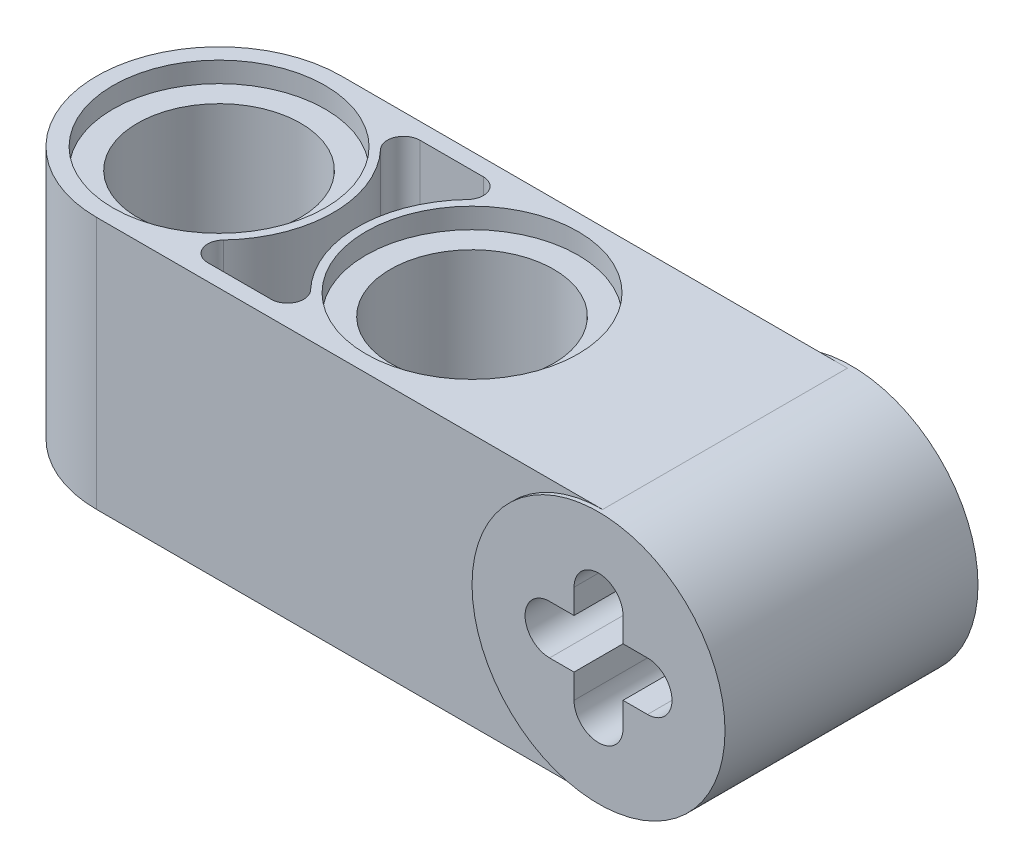
ISO-10303-21;
HEADER;
FILE_DESCRIPTION(('STEP AP214'),'2;1');
FILE_NAME('part.step','',(''),(''),'','','');
FILE_SCHEMA(('AUTOMOTIVE_DESIGN { 1 0 10303 214 1 1 1 1 }'));
ENDSEC;
DATA;
#1=APPLICATION_CONTEXT('core data for automotive mechanical design processes');
#2=APPLICATION_PROTOCOL_DEFINITION('international standard','automotive_design',2000,#1);
#3=PRODUCT_CONTEXT('',#1,'mechanical');
#4=PRODUCT('Part','Part','',(#3));
#5=PRODUCT_RELATED_PRODUCT_CATEGORY('part','',(#4));
#6=PRODUCT_DEFINITION_FORMATION('','',#4);
#7=PRODUCT_DEFINITION_CONTEXT('part definition',#1,'design');
#8=PRODUCT_DEFINITION('design','',#6,#7);
#9=PRODUCT_DEFINITION_SHAPE('','',#8);
#10=(LENGTH_UNIT() NAMED_UNIT(*) SI_UNIT(.MILLI.,.METRE.));
#11=(NAMED_UNIT(*) PLANE_ANGLE_UNIT() SI_UNIT($,.RADIAN.));
#12=(NAMED_UNIT(*) SI_UNIT($,.STERADIAN.) SOLID_ANGLE_UNIT());
#13=UNCERTAINTY_MEASURE_WITH_UNIT(LENGTH_MEASURE(1.E-05),#10,'distance_accuracy_value','');
#14=(GEOMETRIC_REPRESENTATION_CONTEXT(3) GLOBAL_UNCERTAINTY_ASSIGNED_CONTEXT((#13)) GLOBAL_UNIT_ASSIGNED_CONTEXT((#10,
#11,#12)) REPRESENTATION_CONTEXT('',''));
#15=CARTESIAN_POINT('',(0.,0.,0.));
#16=DIRECTION('',(0.,0.,1.));
#17=DIRECTION('',(1.,0.,0.));
#18=AXIS2_PLACEMENT_3D('',#15,#16,#17);
#19=CARTESIAN_POINT('',(7.9375,-8.87295075176705,7.62));
#20=DIRECTION('',(0.,0.,-1.));
#21=DIRECTION('',(1.,0.,0.));
#22=AXIS2_PLACEMENT_3D('',#19,#20,#21);
#23=PLANE('',#22);
#24=CARTESIAN_POINT('',(8.001,0.,7.62));
#25=DIRECTION('',(0.,0.,1.));
#26=DIRECTION('',(1.,0.,0.));
#27=AXIS2_PLACEMENT_3D('',#24,#25,#26);
#28=CIRCLE('',#27,3.937);
#29=CARTESIAN_POINT('',(8.001,3.937,7.62));
#30=VERTEX_POINT('',#29);
#31=CARTESIAN_POINT('',(8.001,-3.937,7.62));
#32=VERTEX_POINT('',#31);
#33=EDGE_CURVE('E59',#30,#32,#28,.T.);
#34=ORIENTED_EDGE('',*,*,#33,.F.);
#35=DIRECTION('',(-1.,0.,0.));
#36=VECTOR('',#35,1.);
#37=CARTESIAN_POINT('',(7.9375,3.937,7.62));
#38=LINE('',#37,#36);
#39=CARTESIAN_POINT('',(-7.74700000000001,3.937,7.62000000000003));
#40=VERTEX_POINT('',#39);
#41=EDGE_CURVE('E408',#30,#40,#38,.T.);
#42=ORIENTED_EDGE('',*,*,#41,.T.);
#43=DIRECTION('',(0.,-1.,0.));
#44=VECTOR('',#43,1.);
#45=CARTESIAN_POINT('',(-7.74700000000001,0.,7.62000000000003));
#46=LINE('',#45,#44);
#47=CARTESIAN_POINT('',(-7.74700000000001,-3.937,7.62000000000003));
#48=VERTEX_POINT('',#47);
#49=EDGE_CURVE('E368',#40,#48,#46,.T.);
#50=ORIENTED_EDGE('',*,*,#49,.T.);
#51=DIRECTION('',(-1.,0.,0.));
#52=VECTOR('',#51,1.);
#53=CARTESIAN_POINT('',(7.93749999999999,-3.937,7.62));
#54=LINE('',#53,#52);
#55=EDGE_CURVE('E404',#32,#48,#54,.T.);
#56=ORIENTED_EDGE('',*,*,#55,.F.);
#57=EDGE_LOOP('',(#34,#42,#50,#56));
#58=FACE_BOUND('',#57,.T.);
#59=ADVANCED_FACE('F34',(#58),#23,.F.);
#60=CARTESIAN_POINT('',(8.001,-1.524,3.81));
#61=DIRECTION('',(0.,0.,-1.));
#62=DIRECTION('',(-1.,0.,0.));
#63=AXIS2_PLACEMENT_3D('',#60,#61,#62);
#64=CYLINDRICAL_SURFACE('',#63,0.762);
#65=DIRECTION('',(0.,0.,-1.));
#66=VECTOR('',#65,1.);
#67=CARTESIAN_POINT('',(8.763,-1.524,3.81));
#68=LINE('',#67,#66);
#69=CARTESIAN_POINT('',(8.763,-1.524,7.747));
#70=VERTEX_POINT('',#69);
#71=CARTESIAN_POINT('',(8.763,-1.524,-0.127));
#72=VERTEX_POINT('',#71);
#73=EDGE_CURVE('E415',#70,#72,#68,.T.);
#74=ORIENTED_EDGE('',*,*,#73,.T.);
#75=CARTESIAN_POINT('',(8.001,-1.524,-0.127));
#76=DIRECTION('',(0.,0.,1.));
#77=DIRECTION('',(1.,0.,0.));
#78=AXIS2_PLACEMENT_3D('',#75,#76,#77);
#79=CIRCLE('',#78,0.762);
#80=CARTESIAN_POINT('',(7.239,-1.524,-0.127));
#81=VERTEX_POINT('',#80);
#82=EDGE_CURVE('E242',#81,#72,#79,.T.);
#83=ORIENTED_EDGE('',*,*,#82,.F.);
#84=DIRECTION('',(0.,0.,-1.));
#85=VECTOR('',#84,1.);
#86=CARTESIAN_POINT('',(7.239,-1.524,3.81));
#87=LINE('',#86,#85);
#88=CARTESIAN_POINT('',(7.239,-1.524,7.747));
#89=VERTEX_POINT('',#88);
#90=EDGE_CURVE('E11',#89,#81,#87,.T.);
#91=ORIENTED_EDGE('',*,*,#90,.F.);
#92=CARTESIAN_POINT('',(8.001,-1.524,7.747));
#93=DIRECTION('',(0.,0.,1.));
#94=DIRECTION('',(1.,0.,0.));
#95=AXIS2_PLACEMENT_3D('',#92,#93,#94);
#96=CIRCLE('',#95,0.762);
#97=EDGE_CURVE('E262',#89,#70,#96,.T.);
#98=ORIENTED_EDGE('',*,*,#97,.T.);
#99=EDGE_LOOP('',(#74,#83,#91,#98));
#100=FACE_BOUND('',#99,.T.);
#101=ADVANCED_FACE('F451',(#100),#64,.F.);
#102=CARTESIAN_POINT('',(7.239,-8.87295075176705,3.81));
#103=DIRECTION('',(1.,0.,0.));
#104=DIRECTION('',(0.,0.,-1.));
#105=AXIS2_PLACEMENT_3D('',#102,#103,#104);
#106=PLANE('',#105);
#107=ORIENTED_EDGE('',*,*,#90,.T.);
#108=DIRECTION('',(0.,-1.,0.));
#109=VECTOR('',#108,1.);
#110=CARTESIAN_POINT('',(7.239,-0.761999999999999,-0.127));
#111=LINE('',#110,#109);
#112=CARTESIAN_POINT('',(7.239,-0.761999999999999,-0.127));
#113=VERTEX_POINT('',#112);
#114=EDGE_CURVE('E245',#113,#81,#111,.T.);
#115=ORIENTED_EDGE('',*,*,#114,.F.);
#116=DIRECTION('',(0.,0.,-1.));
#117=VECTOR('',#116,1.);
#118=CARTESIAN_POINT('',(7.239,-0.761999999999999,3.81));
#119=LINE('',#118,#117);
#120=CARTESIAN_POINT('',(7.239,-0.761999999999999,7.747));
#121=VERTEX_POINT('',#120);
#122=EDGE_CURVE('E43',#121,#113,#119,.T.);
#123=ORIENTED_EDGE('',*,*,#122,.F.);
#124=DIRECTION('',(0.,-1.,0.));
#125=VECTOR('',#124,1.);
#126=CARTESIAN_POINT('',(7.239,-0.761999999999999,7.747));
#127=LINE('',#126,#125);
#128=EDGE_CURVE('E259',#121,#89,#127,.T.);
#129=ORIENTED_EDGE('',*,*,#128,.T.);
#130=EDGE_LOOP('',(#107,#115,#123,#129));
#131=FACE_BOUND('',#130,.T.);
#132=ADVANCED_FACE('F456',(#131),#106,.T.);
#133=CARTESIAN_POINT('',(7.9375,-0.761999999999999,3.81));
#134=DIRECTION('',(0.,1.,0.));
#135=DIRECTION('',(0.,0.,1.));
#136=AXIS2_PLACEMENT_3D('',#133,#134,#135);
#137=PLANE('',#136);
#138=ORIENTED_EDGE('',*,*,#122,.T.);
#139=DIRECTION('',(1.,0.,0.));
#140=VECTOR('',#139,1.);
#141=CARTESIAN_POINT('',(6.477,-0.761999999999999,-0.127));
#142=LINE('',#141,#140);
#143=CARTESIAN_POINT('',(6.477,-0.761999999999999,-0.127));
#144=VERTEX_POINT('',#143);
#145=EDGE_CURVE('E248',#144,#113,#142,.T.);
#146=ORIENTED_EDGE('',*,*,#145,.F.);
#147=DIRECTION('',(0.,0.,-1.));
#148=VECTOR('',#147,1.);
#149=CARTESIAN_POINT('',(6.477,-0.761999999999999,3.81));
#150=LINE('',#149,#148);
#151=CARTESIAN_POINT('',(6.477,-0.761999999999999,7.747));
#152=VERTEX_POINT('',#151);
#153=EDGE_CURVE('E207',#152,#144,#150,.T.);
#154=ORIENTED_EDGE('',*,*,#153,.F.);
#155=DIRECTION('',(1.,0.,0.));
#156=VECTOR('',#155,1.);
#157=CARTESIAN_POINT('',(6.477,-0.761999999999999,7.747));
#158=LINE('',#157,#156);
#159=EDGE_CURVE('E256',#152,#121,#158,.T.);
#160=ORIENTED_EDGE('',*,*,#159,.T.);
#161=EDGE_LOOP('',(#138,#146,#154,#160));
#162=FACE_BOUND('',#161,.T.);
#163=ADVANCED_FACE('F476',(#162),#137,.T.);
#164=CARTESIAN_POINT('',(6.477,0.,3.81));
#165=DIRECTION('',(0.,0.,-1.));
#166=DIRECTION('',(-1.,0.,0.));
#167=AXIS2_PLACEMENT_3D('',#164,#165,#166);
#168=CYLINDRICAL_SURFACE('',#167,0.761999999999999);
#169=ORIENTED_EDGE('',*,*,#153,.T.);
#170=CARTESIAN_POINT('',(6.477,0.,-0.127));
#171=DIRECTION('',(0.,0.,1.));
#172=DIRECTION('',(1.,0.,0.));
#173=AXIS2_PLACEMENT_3D('',#170,#171,#172);
#174=CIRCLE('',#173,0.761999999999999);
#175=CARTESIAN_POINT('',(6.477,0.761999999999999,-0.127));
#176=VERTEX_POINT('',#175);
#177=EDGE_CURVE('E211',#176,#144,#174,.T.);
#178=ORIENTED_EDGE('',*,*,#177,.F.);
#179=DIRECTION('',(0.,0.,-1.));
#180=VECTOR('',#179,1.);
#181=CARTESIAN_POINT('',(6.477,0.761999999999999,3.81));
#182=LINE('',#181,#180);
#183=CARTESIAN_POINT('',(6.477,0.761999999999999,7.747));
#184=VERTEX_POINT('',#183);
#185=EDGE_CURVE('E196',#184,#176,#182,.T.);
#186=ORIENTED_EDGE('',*,*,#185,.F.);
#187=CARTESIAN_POINT('',(6.477,0.,7.747));
#188=DIRECTION('',(0.,0.,1.));
#189=DIRECTION('',(1.,0.,0.));
#190=AXIS2_PLACEMENT_3D('',#187,#188,#189);
#191=CIRCLE('',#190,0.761999999999999);
#192=EDGE_CURVE('E253',#184,#152,#191,.T.);
#193=ORIENTED_EDGE('',*,*,#192,.T.);
#194=EDGE_LOOP('',(#169,#178,#186,#193));
#195=FACE_BOUND('',#194,.T.);
#196=ADVANCED_FACE('F212',(#195),#168,.F.);
#197=CARTESIAN_POINT('',(7.9375,0.761999999999999,3.81));
#198=DIRECTION('',(0.,1.,0.));
#199=DIRECTION('',(0.,0.,1.));
#200=AXIS2_PLACEMENT_3D('',#197,#198,#199);
#201=PLANE('',#200);
#202=ORIENTED_EDGE('',*,*,#185,.T.);
#203=DIRECTION('',(-1.,0.,0.));
#204=VECTOR('',#203,1.);
#205=CARTESIAN_POINT('',(6.477,0.761999999999999,-0.127));
#206=LINE('',#205,#204);
#207=CARTESIAN_POINT('',(7.239,0.761999999999999,-0.127));
#208=VERTEX_POINT('',#207);
#209=EDGE_CURVE('E200',#208,#176,#206,.T.);
#210=ORIENTED_EDGE('',*,*,#209,.F.);
#211=DIRECTION('',(0.,0.,-1.));
#212=VECTOR('',#211,1.);
#213=CARTESIAN_POINT('',(7.239,0.761999999999999,3.81));
#214=LINE('',#213,#212);
#215=CARTESIAN_POINT('',(7.239,0.761999999999999,7.747));
#216=VERTEX_POINT('',#215);
#217=EDGE_CURVE('E208',#216,#208,#214,.T.);
#218=ORIENTED_EDGE('',*,*,#217,.F.);
#219=DIRECTION('',(-1.,0.,0.));
#220=VECTOR('',#219,1.);
#221=CARTESIAN_POINT('',(6.477,0.761999999999999,7.747));
#222=LINE('',#221,#220);
#223=EDGE_CURVE('E203',#216,#184,#222,.T.);
#224=ORIENTED_EDGE('',*,*,#223,.T.);
#225=EDGE_LOOP('',(#202,#210,#218,#224));
#226=FACE_BOUND('',#225,.T.);
#227=ADVANCED_FACE('F198',(#226),#201,.F.);
#228=ORIENTED_EDGE('',*,*,#217,.T.);
#229=DIRECTION('',(0.,-1.,0.));
#230=VECTOR('',#229,1.);
#231=CARTESIAN_POINT('',(7.239,1.524,-0.127));
#232=LINE('',#231,#230);
#233=CARTESIAN_POINT('',(7.239,1.524,-0.127));
#234=VERTEX_POINT('',#233);
#235=EDGE_CURVE('E221',#234,#208,#232,.T.);
#236=ORIENTED_EDGE('',*,*,#235,.F.);
#237=DIRECTION('',(0.,0.,-1.));
#238=VECTOR('',#237,1.);
#239=CARTESIAN_POINT('',(7.239,1.524,3.81));
#240=LINE('',#239,#238);
#241=CARTESIAN_POINT('',(7.239,1.524,7.747));
#242=VERTEX_POINT('',#241);
#243=EDGE_CURVE('E427',#242,#234,#240,.T.);
#244=ORIENTED_EDGE('',*,*,#243,.F.);
#245=DIRECTION('',(0.,-1.,0.));
#246=VECTOR('',#245,1.);
#247=CARTESIAN_POINT('',(7.239,1.524,7.747));
#248=LINE('',#247,#246);
#249=EDGE_CURVE('E283',#242,#216,#248,.T.);
#250=ORIENTED_EDGE('',*,*,#249,.T.);
#251=EDGE_LOOP('',(#228,#236,#244,#250));
#252=FACE_BOUND('',#251,.T.);
#253=ADVANCED_FACE('F487',(#252),#106,.T.);
#254=CARTESIAN_POINT('',(8.001,1.524,3.81));
#255=DIRECTION('',(0.,0.,-1.));
#256=DIRECTION('',(-1.,0.,0.));
#257=AXIS2_PLACEMENT_3D('',#254,#255,#256);
#258=CYLINDRICAL_SURFACE('',#257,0.762);
#259=ORIENTED_EDGE('',*,*,#243,.T.);
#260=CARTESIAN_POINT('',(8.001,1.524,-0.127));
#261=DIRECTION('',(0.,0.,1.));
#262=DIRECTION('',(1.,0.,0.));
#263=AXIS2_PLACEMENT_3D('',#260,#261,#262);
#264=CIRCLE('',#263,0.762);
#265=CARTESIAN_POINT('',(8.763,1.524,-0.127));
#266=VERTEX_POINT('',#265);
#267=EDGE_CURVE('E223',#266,#234,#264,.T.);
#268=ORIENTED_EDGE('',*,*,#267,.F.);
#269=DIRECTION('',(0.,0.,-1.));
#270=VECTOR('',#269,1.);
#271=CARTESIAN_POINT('',(8.763,1.524,3.81));
#272=LINE('',#271,#270);
#273=CARTESIAN_POINT('',(8.763,1.524,7.747));
#274=VERTEX_POINT('',#273);
#275=EDGE_CURVE('E425',#274,#266,#272,.T.);
#276=ORIENTED_EDGE('',*,*,#275,.F.);
#277=CARTESIAN_POINT('',(8.001,1.524,7.747));
#278=DIRECTION('',(0.,0.,1.));
#279=DIRECTION('',(1.,0.,0.));
#280=AXIS2_PLACEMENT_3D('',#277,#278,#279);
#281=CIRCLE('',#280,0.762);
#282=EDGE_CURVE('E280',#274,#242,#281,.T.);
#283=ORIENTED_EDGE('',*,*,#282,.T.);
#284=EDGE_LOOP('',(#259,#268,#276,#283));
#285=FACE_BOUND('',#284,.T.);
#286=ADVANCED_FACE('F484',(#285),#258,.F.);
#287=CARTESIAN_POINT('',(8.763,-8.87295075176705,3.81));
#288=DIRECTION('',(1.,0.,0.));
#289=DIRECTION('',(0.,0.,-1.));
#290=AXIS2_PLACEMENT_3D('',#287,#288,#289);
#291=PLANE('',#290);
#292=ORIENTED_EDGE('',*,*,#275,.T.);
#293=DIRECTION('',(0.,1.,0.));
#294=VECTOR('',#293,1.);
#295=CARTESIAN_POINT('',(8.763,1.524,-0.127));
#296=LINE('',#295,#294);
#297=CARTESIAN_POINT('',(8.763,0.761999999999999,-0.127));
#298=VERTEX_POINT('',#297);
#299=EDGE_CURVE('E227',#298,#266,#296,.T.);
#300=ORIENTED_EDGE('',*,*,#299,.F.);
#301=DIRECTION('',(0.,0.,-1.));
#302=VECTOR('',#301,1.);
#303=CARTESIAN_POINT('',(8.763,0.761999999999999,3.81));
#304=LINE('',#303,#302);
#305=CARTESIAN_POINT('',(8.763,0.761999999999999,7.747));
#306=VERTEX_POINT('',#305);
#307=EDGE_CURVE('E423',#306,#298,#304,.T.);
#308=ORIENTED_EDGE('',*,*,#307,.F.);
#309=DIRECTION('',(0.,1.,0.));
#310=VECTOR('',#309,1.);
#311=CARTESIAN_POINT('',(8.763,1.524,7.747));
#312=LINE('',#311,#310);
#313=EDGE_CURVE('E277',#306,#274,#312,.T.);
#314=ORIENTED_EDGE('',*,*,#313,.T.);
#315=EDGE_LOOP('',(#292,#300,#308,#314));
#316=FACE_BOUND('',#315,.T.);
#317=ADVANCED_FACE('F470',(#316),#291,.F.);
#318=ORIENTED_EDGE('',*,*,#307,.T.);
#319=DIRECTION('',(-1.,0.,0.));
#320=VECTOR('',#319,1.);
#321=CARTESIAN_POINT('',(8.763,0.761999999999999,-0.127));
#322=LINE('',#321,#320);
#323=CARTESIAN_POINT('',(9.525,0.761999999999999,-0.127));
#324=VERTEX_POINT('',#323);
#325=EDGE_CURVE('E230',#324,#298,#322,.T.);
#326=ORIENTED_EDGE('',*,*,#325,.F.);
#327=DIRECTION('',(0.,0.,-1.));
#328=VECTOR('',#327,1.);
#329=CARTESIAN_POINT('',(9.525,0.761999999999999,3.81));
#330=LINE('',#329,#328);
#331=CARTESIAN_POINT('',(9.525,0.761999999999999,7.747));
#332=VERTEX_POINT('',#331);
#333=EDGE_CURVE('E421',#332,#324,#330,.T.);
#334=ORIENTED_EDGE('',*,*,#333,.F.);
#335=DIRECTION('',(-1.,0.,0.));
#336=VECTOR('',#335,1.);
#337=CARTESIAN_POINT('',(8.763,0.761999999999999,7.747));
#338=LINE('',#337,#336);
#339=EDGE_CURVE('E274',#332,#306,#338,.T.);
#340=ORIENTED_EDGE('',*,*,#339,.T.);
#341=EDGE_LOOP('',(#318,#326,#334,#340));
#342=FACE_BOUND('',#341,.T.);
#343=ADVANCED_FACE('F479',(#342),#201,.F.);
#344=CARTESIAN_POINT('',(9.525,0.,3.81));
#345=DIRECTION('',(0.,0.,-1.));
#346=DIRECTION('',(-1.,0.,0.));
#347=AXIS2_PLACEMENT_3D('',#344,#345,#346);
#348=CYLINDRICAL_SURFACE('',#347,0.761999999999999);
#349=ORIENTED_EDGE('',*,*,#333,.T.);
#350=CARTESIAN_POINT('',(9.525,0.,-0.127));
#351=DIRECTION('',(0.,0.,1.));
#352=DIRECTION('',(1.,0.,0.));
#353=AXIS2_PLACEMENT_3D('',#350,#351,#352);
#354=CIRCLE('',#353,0.761999999999999);
#355=CARTESIAN_POINT('',(9.525,-0.761999999999999,-0.127));
#356=VERTEX_POINT('',#355);
#357=EDGE_CURVE('E233',#356,#324,#354,.T.);
#358=ORIENTED_EDGE('',*,*,#357,.F.);
#359=DIRECTION('',(0.,0.,-1.));
#360=VECTOR('',#359,1.);
#361=CARTESIAN_POINT('',(9.525,-0.761999999999999,3.81));
#362=LINE('',#361,#360);
#363=CARTESIAN_POINT('',(9.525,-0.761999999999999,7.747));
#364=VERTEX_POINT('',#363);
#365=EDGE_CURVE('E419',#364,#356,#362,.T.);
#366=ORIENTED_EDGE('',*,*,#365,.F.);
#367=CARTESIAN_POINT('',(9.525,0.,7.747));
#368=DIRECTION('',(0.,0.,1.));
#369=DIRECTION('',(1.,0.,0.));
#370=AXIS2_PLACEMENT_3D('',#367,#368,#369);
#371=CIRCLE('',#370,0.761999999999999);
#372=EDGE_CURVE('E271',#364,#332,#371,.T.);
#373=ORIENTED_EDGE('',*,*,#372,.T.);
#374=EDGE_LOOP('',(#349,#358,#366,#373));
#375=FACE_BOUND('',#374,.T.);
#376=ADVANCED_FACE('F474',(#375),#348,.F.);
#377=ORIENTED_EDGE('',*,*,#365,.T.);
#378=DIRECTION('',(1.,0.,0.));
#379=VECTOR('',#378,1.);
#380=CARTESIAN_POINT('',(8.763,-0.761999999999999,-0.127));
#381=LINE('',#380,#379);
#382=CARTESIAN_POINT('',(8.763,-0.761999999999999,-0.127));
#383=VERTEX_POINT('',#382);
#384=EDGE_CURVE('E236',#383,#356,#381,.T.);
#385=ORIENTED_EDGE('',*,*,#384,.F.);
#386=DIRECTION('',(0.,0.,-1.));
#387=VECTOR('',#386,1.);
#388=CARTESIAN_POINT('',(8.763,-0.761999999999999,3.81));
#389=LINE('',#388,#387);
#390=CARTESIAN_POINT('',(8.763,-0.761999999999999,7.747));
#391=VERTEX_POINT('',#390);
#392=EDGE_CURVE('E417',#391,#383,#389,.T.);
#393=ORIENTED_EDGE('',*,*,#392,.F.);
#394=DIRECTION('',(1.,0.,0.));
#395=VECTOR('',#394,1.);
#396=CARTESIAN_POINT('',(8.763,-0.761999999999999,7.747));
#397=LINE('',#396,#395);
#398=EDGE_CURVE('E268',#391,#364,#397,.T.);
#399=ORIENTED_EDGE('',*,*,#398,.T.);
#400=EDGE_LOOP('',(#377,#385,#393,#399));
#401=FACE_BOUND('',#400,.T.);
#402=ADVANCED_FACE('F471',(#401),#137,.T.);
#403=CARTESIAN_POINT('',(7.93749999999999,-3.937,3.81));
#404=DIRECTION('',(0.,-1.,0.));
#405=DIRECTION('',(1.,0.,0.));
#406=AXIS2_PLACEMENT_3D('',#403,#404,#405);
#407=PLANE('',#406);
#408=CARTESIAN_POINT('',(-7.74700000000001,-3.937,3.81000000000003));
#409=DIRECTION('',(0.,1.,0.));
#410=DIRECTION('',(1.,0.,0.));
#411=AXIS2_PLACEMENT_3D('',#408,#409,#410);
#412=CIRCLE('',#411,3.81);
#413=CARTESIAN_POINT('',(-7.74700000000001,-3.937,0.));
#414=VERTEX_POINT('',#413);
#415=EDGE_CURVE('E343',#48,#414,#412,.F.);
#416=ORIENTED_EDGE('',*,*,#415,.T.);
#417=DIRECTION('',(-1.,0.,0.));
#418=VECTOR('',#417,1.);
#419=CARTESIAN_POINT('',(7.93749999999999,-3.937,0.));
#420=LINE('',#419,#418);
#421=CARTESIAN_POINT('',(8.001,-3.937,0.));
#422=VERTEX_POINT('',#421);
#423=EDGE_CURVE('E410',#422,#414,#420,.T.);
#424=ORIENTED_EDGE('',*,*,#423,.F.);
#425=DIRECTION('',(0.,0.,-1.));
#426=VECTOR('',#425,1.);
#427=CARTESIAN_POINT('',(8.001,-3.937,3.81));
#428=LINE('',#427,#426);
#429=EDGE_CURVE('E38',#32,#422,#428,.T.);
#430=ORIENTED_EDGE('',*,*,#429,.F.);
#431=ORIENTED_EDGE('',*,*,#55,.T.);
#432=EDGE_LOOP('',(#416,#424,#430,#431));
#433=FACE_BOUND('',#432,.T.);
#434=DIRECTION('',(1.,0.,0.));
#435=VECTOR('',#434,1.);
#436=CARTESIAN_POINT('',(-7.74699999999998,-3.937,0.507999999999991));
#437=LINE('',#436,#435);
#438=CARTESIAN_POINT('',(-4.79578669018996,-3.937,0.508000000000027));
#439=VERTEX_POINT('',#438);
#440=CARTESIAN_POINT('',(-2.82421330981005,-3.937,0.507999999999996));
#441=VERTEX_POINT('',#440);
#442=EDGE_CURVE('E380',#439,#441,#437,.T.);
#443=ORIENTED_EDGE('',*,*,#442,.F.);
#444=CARTESIAN_POINT('',(-4.79578669018996,-3.937,1.01600000000003));
#445=DIRECTION('',(0.,1.,0.));
#446=DIRECTION('',(1.,0.,0.));
#447=AXIS2_PLACEMENT_3D('',#444,#445,#446);
#448=CIRCLE('',#447,0.508);
#449=CARTESIAN_POINT('',(-5.16468835391622,-3.937,1.36525000000003));
#450=VERTEX_POINT('',#449);
#451=EDGE_CURVE('E352',#439,#450,#448,.T.);
#452=ORIENTED_EDGE('',*,*,#451,.T.);
#453=CARTESIAN_POINT('',(-7.74700000000001,-3.937,3.81000000000003));
#454=DIRECTION('',(0.,1.,0.));
#455=DIRECTION('',(1.,0.,0.));
#456=AXIS2_PLACEMENT_3D('',#453,#454,#455);
#457=CIRCLE('',#456,3.556);
#458=CARTESIAN_POINT('',(-5.16468835391622,-3.937,6.25475000000003));
#459=VERTEX_POINT('',#458);
#460=EDGE_CURVE('E349',#450,#459,#457,.F.);
#461=ORIENTED_EDGE('',*,*,#460,.T.);
#462=CARTESIAN_POINT('',(-4.79578669018996,-3.937,6.60400000000003));
#463=DIRECTION('',(0.,1.,0.));
#464=DIRECTION('',(1.,0.,0.));
#465=AXIS2_PLACEMENT_3D('',#462,#463,#464);
#466=CIRCLE('',#465,0.508);
#467=CARTESIAN_POINT('',(-4.79578669018996,-3.937,7.11200000000003));
#468=VERTEX_POINT('',#467);
#469=EDGE_CURVE('E346',#459,#468,#466,.T.);
#470=ORIENTED_EDGE('',*,*,#469,.T.);
#471=DIRECTION('',(1.,0.,0.));
#472=VECTOR('',#471,1.);
#473=CARTESIAN_POINT('',(-7.74700000000002,-3.937,7.112));
#474=LINE('',#473,#472);
#475=CARTESIAN_POINT('',(-2.82421330981005,-3.937,7.112));
#476=VERTEX_POINT('',#475);
#477=EDGE_CURVE('E390',#468,#476,#474,.T.);
#478=ORIENTED_EDGE('',*,*,#477,.T.);
#479=CARTESIAN_POINT('',(-2.82421330981005,-3.937,6.604));
#480=DIRECTION('',(0.,1.,0.));
#481=DIRECTION('',(1.,0.,0.));
#482=AXIS2_PLACEMENT_3D('',#479,#480,#481);
#483=CIRCLE('',#482,0.508);
#484=CARTESIAN_POINT('',(-2.4553116460838,-3.937,6.25475));
#485=VERTEX_POINT('',#484);
#486=EDGE_CURVE('E387',#485,#476,#483,.F.);
#487=ORIENTED_EDGE('',*,*,#486,.F.);
#488=CARTESIAN_POINT('',(0.126999999999999,-3.937,3.81));
#489=DIRECTION('',(0.,1.,0.));
#490=DIRECTION('',(1.,0.,0.));
#491=AXIS2_PLACEMENT_3D('',#488,#489,#490);
#492=CIRCLE('',#491,3.556);
#493=CARTESIAN_POINT('',(-2.4553116460838,-3.937,1.36525));
#494=VERTEX_POINT('',#493);
#495=EDGE_CURVE('E385',#494,#485,#492,.T.);
#496=ORIENTED_EDGE('',*,*,#495,.F.);
#497=CARTESIAN_POINT('',(-2.82421330981005,-3.937,1.016));
#498=DIRECTION('',(0.,1.,0.));
#499=DIRECTION('',(1.,0.,0.));
#500=AXIS2_PLACEMENT_3D('',#497,#498,#499);
#501=CIRCLE('',#500,0.508);
#502=EDGE_CURVE('E383',#441,#494,#501,.F.);
#503=ORIENTED_EDGE('',*,*,#502,.F.);
#504=EDGE_LOOP('',(#443,#452,#461,#470,#478,#487,#496,#503));
#505=FACE_BOUND('',#504,.T.);
#506=CARTESIAN_POINT('',(0.126999999999999,-3.937,3.81));
#507=DIRECTION('',(0.,1.,0.));
#508=DIRECTION('',(1.,0.,0.));
#509=AXIS2_PLACEMENT_3D('',#506,#507,#508);
#510=CIRCLE('',#509,3.302);
#511=CARTESIAN_POINT('',(3.429,-3.937,3.81));
#512=VERTEX_POINT('',#511);
#513=EDGE_CURVE('E371',#512,#512,#510,.T.);
#514=ORIENTED_EDGE('',*,*,#513,.T.);
#515=EDGE_LOOP('',(#514));
#516=FACE_BOUND('',#515,.T.);
#517=CARTESIAN_POINT('',(-7.747,-3.937,3.81));
#518=DIRECTION('',(0.,1.,0.));
#519=DIRECTION('',(1.,0.,0.));
#520=AXIS2_PLACEMENT_3D('',#517,#518,#519);
#521=CIRCLE('',#520,3.302);
#522=CARTESIAN_POINT('',(-4.445,-3.937,3.81));
#523=VERTEX_POINT('',#522);
#524=EDGE_CURVE('E334',#523,#523,#521,.T.);
#525=ORIENTED_EDGE('',*,*,#524,.T.);
#526=EDGE_LOOP('',(#525));
#527=FACE_BOUND('',#526,.T.);
#528=ADVANCED_FACE('F36',(#433,#505,#516,#527),#407,.T.);
#529=CARTESIAN_POINT('',(8.001,0.,3.81));
#530=DIRECTION('',(0.,0.,-1.));
#531=DIRECTION('',(-1.,0.,0.));
#532=AXIS2_PLACEMENT_3D('',#529,#530,#531);
#533=CYLINDRICAL_SURFACE('',#532,3.937);
#534=ORIENTED_EDGE('',*,*,#429,.T.);
#535=CARTESIAN_POINT('',(8.001,0.,0.));
#536=DIRECTION('',(0.,0.,1.));
#537=DIRECTION('',(1.,0.,0.));
#538=AXIS2_PLACEMENT_3D('',#535,#536,#537);
#539=CIRCLE('',#538,3.937);
#540=CARTESIAN_POINT('',(8.001,3.937,0.));
#541=VERTEX_POINT('',#540);
#542=EDGE_CURVE('E51',#541,#422,#539,.T.);
#543=ORIENTED_EDGE('',*,*,#542,.F.);
#544=DIRECTION('',(0.,0.,-1.));
#545=VECTOR('',#544,1.);
#546=CARTESIAN_POINT('',(8.001,3.937,3.81));
#547=LINE('',#546,#545);
#548=EDGE_CURVE('E414',#30,#541,#547,.T.);
#549=ORIENTED_EDGE('',*,*,#548,.F.);
#550=ORIENTED_EDGE('',*,*,#33,.T.);
#551=EDGE_LOOP('',(#534,#543,#549,#550));
#552=FACE_BOUND('',#551,.T.);
#553=CARTESIAN_POINT('',(8.001,0.,7.747));
#554=DIRECTION('',(0.,0.,1.));
#555=DIRECTION('',(1.,0.,0.));
#556=AXIS2_PLACEMENT_3D('',#553,#554,#555);
#557=CIRCLE('',#556,3.937);
#558=CARTESIAN_POINT('',(11.938,0.,7.747));
#559=VERTEX_POINT('',#558);
#560=EDGE_CURVE('E287',#559,#559,#557,.T.);
#561=ORIENTED_EDGE('',*,*,#560,.F.);
#562=EDGE_LOOP('',(#561));
#563=FACE_BOUND('',#562,.T.);
#564=CARTESIAN_POINT('',(8.001,0.,-0.127));
#565=DIRECTION('',(0.,0.,1.));
#566=DIRECTION('',(1.,0.,0.));
#567=AXIS2_PLACEMENT_3D('',#564,#565,#566);
#568=CIRCLE('',#567,3.937);
#569=CARTESIAN_POINT('',(11.938,0.,-0.127));
#570=VERTEX_POINT('',#569);
#571=EDGE_CURVE('E250',#570,#570,#568,.T.);
#572=ORIENTED_EDGE('',*,*,#571,.T.);
#573=EDGE_LOOP('',(#572));
#574=FACE_BOUND('',#573,.T.);
#575=ADVANCED_FACE('F436',(#552,#563,#574),#533,.T.);
#576=CARTESIAN_POINT('',(7.9375,3.937,3.81));
#577=DIRECTION('',(0.,-1.,0.));
#578=DIRECTION('',(1.,0.,0.));
#579=AXIS2_PLACEMENT_3D('',#576,#577,#578);
#580=PLANE('',#579);
#581=DIRECTION('',(-1.,0.,0.));
#582=VECTOR('',#581,1.);
#583=CARTESIAN_POINT('',(7.9375,3.937,0.));
#584=LINE('',#583,#582);
#585=CARTESIAN_POINT('',(-7.74700000000001,3.937,0.));
#586=VERTEX_POINT('',#585);
#587=EDGE_CURVE('E412',#541,#586,#584,.T.);
#588=ORIENTED_EDGE('',*,*,#587,.T.);
#589=CARTESIAN_POINT('',(-7.74700000000001,3.937,3.81000000000003));
#590=DIRECTION('',(0.,1.,0.));
#591=DIRECTION('',(1.,0.,0.));
#592=AXIS2_PLACEMENT_3D('',#589,#590,#591);
#593=CIRCLE('',#592,3.81);
#594=EDGE_CURVE('E298',#40,#586,#593,.F.);
#595=ORIENTED_EDGE('',*,*,#594,.F.);
#596=ORIENTED_EDGE('',*,*,#41,.F.);
#597=ORIENTED_EDGE('',*,*,#548,.T.);
#598=EDGE_LOOP('',(#588,#595,#596,#597));
#599=FACE_BOUND('',#598,.T.);
#600=DIRECTION('',(1.,0.,0.));
#601=VECTOR('',#600,1.);
#602=CARTESIAN_POINT('',(-7.74699999999997,3.937,0.507999999999991));
#603=LINE('',#602,#601);
#604=CARTESIAN_POINT('',(-4.79578669018996,3.937,0.508000000000027));
#605=VERTEX_POINT('',#604);
#606=CARTESIAN_POINT('',(-2.82421330981005,3.937,0.507999999999996));
#607=VERTEX_POINT('',#606);
#608=EDGE_CURVE('E319',#605,#607,#603,.T.);
#609=ORIENTED_EDGE('',*,*,#608,.T.);
#610=CARTESIAN_POINT('',(-2.82421330981005,3.937,1.016));
#611=DIRECTION('',(0.,1.,0.));
#612=DIRECTION('',(1.,0.,0.));
#613=AXIS2_PLACEMENT_3D('',#610,#611,#612);
#614=CIRCLE('',#613,0.508);
#615=CARTESIAN_POINT('',(-2.4553116460838,3.937,1.36525));
#616=VERTEX_POINT('',#615);
#617=EDGE_CURVE('E322',#607,#616,#614,.F.);
#618=ORIENTED_EDGE('',*,*,#617,.T.);
#619=CARTESIAN_POINT('',(0.127,3.937,3.81));
#620=DIRECTION('',(0.,1.,0.));
#621=DIRECTION('',(1.,0.,0.));
#622=AXIS2_PLACEMENT_3D('',#619,#620,#621);
#623=CIRCLE('',#622,3.556);
#624=CARTESIAN_POINT('',(-2.45531164608379,3.937,6.25475));
#625=VERTEX_POINT('',#624);
#626=EDGE_CURVE('E325',#616,#625,#623,.T.);
#627=ORIENTED_EDGE('',*,*,#626,.T.);
#628=CARTESIAN_POINT('',(-2.82421330981005,3.937,6.604));
#629=DIRECTION('',(0.,1.,0.));
#630=DIRECTION('',(1.,0.,0.));
#631=AXIS2_PLACEMENT_3D('',#628,#629,#630);
#632=CIRCLE('',#631,0.508);
#633=CARTESIAN_POINT('',(-2.82421330981005,3.937,7.112));
#634=VERTEX_POINT('',#633);
#635=EDGE_CURVE('E328',#625,#634,#632,.F.);
#636=ORIENTED_EDGE('',*,*,#635,.T.);
#637=DIRECTION('',(1.,0.,0.));
#638=VECTOR('',#637,1.);
#639=CARTESIAN_POINT('',(-7.74700000000002,3.937,7.112));
#640=LINE('',#639,#638);
#641=CARTESIAN_POINT('',(-4.79578669018996,3.937,7.11200000000003));
#642=VERTEX_POINT('',#641);
#643=EDGE_CURVE('E331',#642,#634,#640,.T.);
#644=ORIENTED_EDGE('',*,*,#643,.F.);
#645=CARTESIAN_POINT('',(-4.79578669018996,3.937,6.60400000000003));
#646=DIRECTION('',(0.,1.,0.));
#647=DIRECTION('',(1.,0.,0.));
#648=AXIS2_PLACEMENT_3D('',#645,#646,#647);
#649=CIRCLE('',#648,0.508);
#650=CARTESIAN_POINT('',(-5.16468835391622,3.937,6.25475000000003));
#651=VERTEX_POINT('',#650);
#652=EDGE_CURVE('E301',#651,#642,#649,.T.);
#653=ORIENTED_EDGE('',*,*,#652,.F.);
#654=CARTESIAN_POINT('',(-7.74700000000001,3.937,3.81000000000003));
#655=DIRECTION('',(0.,1.,0.));
#656=DIRECTION('',(1.,0.,0.));
#657=AXIS2_PLACEMENT_3D('',#654,#655,#656);
#658=CIRCLE('',#657,3.556);
#659=CARTESIAN_POINT('',(-5.16468835391622,3.937,1.36525000000003));
#660=VERTEX_POINT('',#659);
#661=EDGE_CURVE('E304',#660,#651,#658,.F.);
#662=ORIENTED_EDGE('',*,*,#661,.F.);
#663=CARTESIAN_POINT('',(-4.79578669018996,3.937,1.01600000000003));
#664=DIRECTION('',(0.,1.,0.));
#665=DIRECTION('',(1.,0.,0.));
#666=AXIS2_PLACEMENT_3D('',#663,#664,#665);
#667=CIRCLE('',#666,0.508);
#668=EDGE_CURVE('E307',#605,#660,#667,.T.);
#669=ORIENTED_EDGE('',*,*,#668,.F.);
#670=EDGE_LOOP('',(#609,#618,#627,#636,#644,#653,#662,#669));
#671=FACE_BOUND('',#670,.T.);
#672=CARTESIAN_POINT('',(0.127,3.937,3.81));
#673=DIRECTION('',(0.,1.,0.));
#674=DIRECTION('',(1.,0.,0.));
#675=AXIS2_PLACEMENT_3D('',#672,#673,#674);
#676=CIRCLE('',#675,3.302);
#677=CARTESIAN_POINT('',(3.429,3.937,3.81));
#678=VERTEX_POINT('',#677);
#679=EDGE_CURVE('E310',#678,#678,#676,.T.);
#680=ORIENTED_EDGE('',*,*,#679,.F.);
#681=EDGE_LOOP('',(#680));
#682=FACE_BOUND('',#681,.T.);
#683=CARTESIAN_POINT('',(-7.747,3.937,3.81));
#684=DIRECTION('',(0.,1.,0.));
#685=DIRECTION('',(1.,0.,0.));
#686=AXIS2_PLACEMENT_3D('',#683,#684,#685);
#687=CIRCLE('',#686,3.302);
#688=CARTESIAN_POINT('',(-4.445,3.937,3.81));
#689=VERTEX_POINT('',#688);
#690=EDGE_CURVE('E290',#689,#689,#687,.T.);
#691=ORIENTED_EDGE('',*,*,#690,.F.);
#692=EDGE_LOOP('',(#691));
#693=FACE_BOUND('',#692,.T.);
#694=ADVANCED_FACE('F448',(#599,#671,#682,#693),#580,.F.);
#695=ORIENTED_EDGE('',*,*,#392,.T.);
#696=DIRECTION('',(0.,1.,0.));
#697=VECTOR('',#696,1.);
#698=CARTESIAN_POINT('',(8.763,-0.761999999999999,-0.127));
#699=LINE('',#698,#697);
#700=EDGE_CURVE('E239',#72,#383,#699,.T.);
#701=ORIENTED_EDGE('',*,*,#700,.F.);
#702=ORIENTED_EDGE('',*,*,#73,.F.);
#703=DIRECTION('',(0.,1.,0.));
#704=VECTOR('',#703,1.);
#705=CARTESIAN_POINT('',(8.763,-0.761999999999999,7.747));
#706=LINE('',#705,#704);
#707=EDGE_CURVE('E265',#70,#391,#706,.T.);
#708=ORIENTED_EDGE('',*,*,#707,.T.);
#709=EDGE_LOOP('',(#695,#701,#702,#708));
#710=FACE_BOUND('',#709,.T.);
#711=ADVANCED_FACE('F466',(#710),#291,.F.);
#712=CARTESIAN_POINT('',(7.9375,-8.87295075176705,0.));
#713=DIRECTION('',(0.,0.,1.));
#714=DIRECTION('',(1.,0.,0.));
#715=AXIS2_PLACEMENT_3D('',#712,#713,#714);
#716=PLANE('',#715);
#717=ORIENTED_EDGE('',*,*,#587,.F.);
#718=ORIENTED_EDGE('',*,*,#542,.T.);
#719=ORIENTED_EDGE('',*,*,#423,.T.);
#720=DIRECTION('',(0.,-1.,0.));
#721=VECTOR('',#720,1.);
#722=CARTESIAN_POINT('',(-7.74700000000001,0.,0.));
#723=LINE('',#722,#721);
#724=EDGE_CURVE('E355',#586,#414,#723,.T.);
#725=ORIENTED_EDGE('',*,*,#724,.F.);
#726=EDGE_LOOP('',(#717,#718,#719,#725));
#727=FACE_BOUND('',#726,.T.);
#728=ADVANCED_FACE('F443',(#727),#716,.F.);
#729=CARTESIAN_POINT('',(-7.74699999999998,0.,0.507999999999991));
#730=DIRECTION('',(0.,0.,-1.));
#731=DIRECTION('',(-1.,0.,0.));
#732=AXIS2_PLACEMENT_3D('',#729,#730,#731);
#733=PLANE('',#732);
#734=ORIENTED_EDGE('',*,*,#442,.T.);
#735=DIRECTION('',(0.,-1.,0.));
#736=VECTOR('',#735,1.);
#737=CARTESIAN_POINT('',(-2.82421330981005,0.,0.507999999999996));
#738=LINE('',#737,#736);
#739=EDGE_CURVE('E401',#607,#441,#738,.T.);
#740=ORIENTED_EDGE('',*,*,#739,.F.);
#741=ORIENTED_EDGE('',*,*,#608,.F.);
#742=DIRECTION('',(0.,-1.,0.));
#743=VECTOR('',#742,1.);
#744=CARTESIAN_POINT('',(-4.79578669018996,0.,0.508000000000027));
#745=LINE('',#744,#743);
#746=EDGE_CURVE('E358',#605,#439,#745,.T.);
#747=ORIENTED_EDGE('',*,*,#746,.T.);
#748=EDGE_LOOP('',(#734,#740,#741,#747));
#749=FACE_BOUND('',#748,.T.);
#750=ADVANCED_FACE('F465',(#749),#733,.F.);
#751=CARTESIAN_POINT('',(-2.82421330981005,0.,1.016));
#752=DIRECTION('',(0.,-1.,0.));
#753=DIRECTION('',(-1.,0.,0.));
#754=AXIS2_PLACEMENT_3D('',#751,#752,#753);
#755=CYLINDRICAL_SURFACE('',#754,0.508);
#756=ORIENTED_EDGE('',*,*,#502,.T.);
#757=DIRECTION('',(0.,-1.,0.));
#758=VECTOR('',#757,1.);
#759=CARTESIAN_POINT('',(-2.4553116460838,0.,1.36525));
#760=LINE('',#759,#758);
#761=EDGE_CURVE('E398',#616,#494,#760,.T.);
#762=ORIENTED_EDGE('',*,*,#761,.F.);
#763=ORIENTED_EDGE('',*,*,#617,.F.);
#764=ORIENTED_EDGE('',*,*,#739,.T.);
#765=EDGE_LOOP('',(#756,#762,#763,#764));
#766=FACE_BOUND('',#765,.T.);
#767=ADVANCED_FACE('F747',(#766),#755,.F.);
#768=CARTESIAN_POINT('',(0.127,0.,3.81));
#769=DIRECTION('',(0.,-1.,0.));
#770=DIRECTION('',(-1.,0.,0.));
#771=AXIS2_PLACEMENT_3D('',#768,#769,#770);
#772=CYLINDRICAL_SURFACE('',#771,3.556);
#773=ORIENTED_EDGE('',*,*,#495,.T.);
#774=DIRECTION('',(0.,-1.,0.));
#775=VECTOR('',#774,1.);
#776=CARTESIAN_POINT('',(-2.4553116460838,0.,6.25475));
#777=LINE('',#776,#775);
#778=EDGE_CURVE('E395',#625,#485,#777,.T.);
#779=ORIENTED_EDGE('',*,*,#778,.F.);
#780=ORIENTED_EDGE('',*,*,#626,.F.);
#781=ORIENTED_EDGE('',*,*,#761,.T.);
#782=EDGE_LOOP('',(#773,#779,#780,#781));
#783=FACE_BOUND('',#782,.T.);
#784=ADVANCED_FACE('F736',(#783),#772,.T.);
#785=CARTESIAN_POINT('',(-2.82421330981005,0.,6.604));
#786=DIRECTION('',(0.,-1.,0.));
#787=DIRECTION('',(-1.,0.,0.));
#788=AXIS2_PLACEMENT_3D('',#785,#786,#787);
#789=CYLINDRICAL_SURFACE('',#788,0.508);
#790=ORIENTED_EDGE('',*,*,#486,.T.);
#791=DIRECTION('',(0.,-1.,0.));
#792=VECTOR('',#791,1.);
#793=CARTESIAN_POINT('',(-2.82421330981005,0.,7.112));
#794=LINE('',#793,#792);
#795=EDGE_CURVE('E393',#634,#476,#794,.T.);
#796=ORIENTED_EDGE('',*,*,#795,.F.);
#797=ORIENTED_EDGE('',*,*,#635,.F.);
#798=ORIENTED_EDGE('',*,*,#778,.T.);
#799=EDGE_LOOP('',(#790,#796,#797,#798));
#800=FACE_BOUND('',#799,.T.);
#801=ADVANCED_FACE('F724',(#800),#789,.F.);
#802=CARTESIAN_POINT('',(-7.74700000000002,0.,7.112));
#803=DIRECTION('',(0.,0.,-1.));
#804=DIRECTION('',(-1.,0.,0.));
#805=AXIS2_PLACEMENT_3D('',#802,#803,#804);
#806=PLANE('',#805);
#807=ORIENTED_EDGE('',*,*,#477,.F.);
#808=DIRECTION('',(0.,-1.,0.));
#809=VECTOR('',#808,1.);
#810=CARTESIAN_POINT('',(-4.79578669018996,0.,7.11200000000003));
#811=LINE('',#810,#809);
#812=EDGE_CURVE('E365',#642,#468,#811,.T.);
#813=ORIENTED_EDGE('',*,*,#812,.F.);
#814=ORIENTED_EDGE('',*,*,#643,.T.);
#815=ORIENTED_EDGE('',*,*,#795,.T.);
#816=EDGE_LOOP('',(#807,#813,#814,#815));
#817=FACE_BOUND('',#816,.T.);
#818=ADVANCED_FACE('F714',(#817),#806,.T.);
#819=CARTESIAN_POINT('',(0.127,0.,3.81));
#820=DIRECTION('',(0.,-1.,0.));
#821=DIRECTION('',(-1.,0.,0.));
#822=AXIS2_PLACEMENT_3D('',#819,#820,#821);
#823=CYLINDRICAL_SURFACE('',#822,2.54);
#824=CARTESIAN_POINT('',(0.126999999999999,-3.302,3.81));
#825=DIRECTION('',(0.,1.,0.));
#826=DIRECTION('',(1.,0.,0.));
#827=AXIS2_PLACEMENT_3D('',#824,#825,#826);
#828=CIRCLE('',#827,2.54);
#829=CARTESIAN_POINT('',(2.667,-3.302,3.81));
#830=VERTEX_POINT('',#829);
#831=EDGE_CURVE('E377',#830,#830,#828,.T.);
#832=ORIENTED_EDGE('',*,*,#831,.F.);
#833=EDGE_LOOP('',(#832));
#834=FACE_BOUND('',#833,.T.);
#835=CARTESIAN_POINT('',(0.127,3.302,3.81));
#836=DIRECTION('',(0.,1.,0.));
#837=DIRECTION('',(1.,0.,0.));
#838=AXIS2_PLACEMENT_3D('',#835,#836,#837);
#839=CIRCLE('',#838,2.54);
#840=CARTESIAN_POINT('',(2.667,3.302,3.81));
#841=VERTEX_POINT('',#840);
#842=EDGE_CURVE('E316',#841,#841,#839,.T.);
#843=ORIENTED_EDGE('',*,*,#842,.T.);
#844=EDGE_LOOP('',(#843));
#845=FACE_BOUND('',#844,.T.);
#846=ADVANCED_FACE('F461',(#834,#845),#823,.F.);
#847=CARTESIAN_POINT('',(0.126999999999999,-3.302,3.81));
#848=DIRECTION('',(0.,-1.,0.));
#849=DIRECTION('',(-1.,0.,0.));
#850=AXIS2_PLACEMENT_3D('',#847,#848,#849);
#851=CYLINDRICAL_SURFACE('',#850,3.302);
#852=CARTESIAN_POINT('',(0.126999999999999,-3.302,3.81));
#853=DIRECTION('',(0.,1.,0.));
#854=DIRECTION('',(1.,0.,0.));
#855=AXIS2_PLACEMENT_3D('',#852,#853,#854);
#856=CIRCLE('',#855,3.302);
#857=CARTESIAN_POINT('',(3.429,-3.302,3.81));
#858=VERTEX_POINT('',#857);
#859=EDGE_CURVE('E374',#858,#858,#856,.T.);
#860=ORIENTED_EDGE('',*,*,#859,.T.);
#861=EDGE_LOOP('',(#860));
#862=FACE_BOUND('',#861,.T.);
#863=ORIENTED_EDGE('',*,*,#513,.F.);
#864=EDGE_LOOP('',(#863));
#865=FACE_BOUND('',#864,.T.);
#866=ADVANCED_FACE('F694',(#862,#865),#851,.F.);
#867=CARTESIAN_POINT('',(0.126999999999999,-3.302,3.81));
#868=DIRECTION('',(0.,1.,0.));
#869=DIRECTION('',(1.,0.,0.));
#870=AXIS2_PLACEMENT_3D('',#867,#868,#869);
#871=PLANE('',#870);
#872=ORIENTED_EDGE('',*,*,#831,.T.);
#873=EDGE_LOOP('',(#872));
#874=FACE_BOUND('',#873,.T.);
#875=ORIENTED_EDGE('',*,*,#859,.F.);
#876=EDGE_LOOP('',(#875));
#877=FACE_BOUND('',#876,.T.);
#878=ADVANCED_FACE('F685',(#874,#877),#871,.F.);
#879=CARTESIAN_POINT('',(-7.74700000000001,0.,3.81000000000003));
#880=DIRECTION('',(0.,-1.,0.));
#881=DIRECTION('',(-1.,0.,0.));
#882=AXIS2_PLACEMENT_3D('',#879,#880,#881);
#883=CYLINDRICAL_SURFACE('',#882,3.81);
#884=ORIENTED_EDGE('',*,*,#415,.F.);
#885=ORIENTED_EDGE('',*,*,#49,.F.);
#886=ORIENTED_EDGE('',*,*,#594,.T.);
#887=ORIENTED_EDGE('',*,*,#724,.T.);
#888=EDGE_LOOP('',(#884,#885,#886,#887));
#889=FACE_BOUND('',#888,.T.);
#890=ADVANCED_FACE('F445',(#889),#883,.T.);
#891=CARTESIAN_POINT('',(-4.79578669018996,0.,6.60400000000003));
#892=DIRECTION('',(0.,-1.,0.));
#893=DIRECTION('',(-1.,0.,0.));
#894=AXIS2_PLACEMENT_3D('',#891,#892,#893);
#895=CYLINDRICAL_SURFACE('',#894,0.508);
#896=ORIENTED_EDGE('',*,*,#469,.F.);
#897=DIRECTION('',(0.,-1.,0.));
#898=VECTOR('',#897,1.);
#899=CARTESIAN_POINT('',(-5.16468835391622,0.,6.25475000000003));
#900=LINE('',#899,#898);
#901=EDGE_CURVE('E363',#651,#459,#900,.T.);
#902=ORIENTED_EDGE('',*,*,#901,.F.);
#903=ORIENTED_EDGE('',*,*,#652,.T.);
#904=ORIENTED_EDGE('',*,*,#812,.T.);
#905=EDGE_LOOP('',(#896,#902,#903,#904));
#906=FACE_BOUND('',#905,.T.);
#907=ADVANCED_FACE('F664',(#906),#895,.F.);
#908=CARTESIAN_POINT('',(-7.74700000000001,0.,3.81000000000003));
#909=DIRECTION('',(0.,-1.,0.));
#910=DIRECTION('',(-1.,0.,0.));
#911=AXIS2_PLACEMENT_3D('',#908,#909,#910);
#912=CYLINDRICAL_SURFACE('',#911,3.556);
#913=ORIENTED_EDGE('',*,*,#460,.F.);
#914=DIRECTION('',(0.,-1.,0.));
#915=VECTOR('',#914,1.);
#916=CARTESIAN_POINT('',(-5.16468835391622,0.,1.36525000000003));
#917=LINE('',#916,#915);
#918=EDGE_CURVE('E361',#660,#450,#917,.T.);
#919=ORIENTED_EDGE('',*,*,#918,.F.);
#920=ORIENTED_EDGE('',*,*,#661,.T.);
#921=ORIENTED_EDGE('',*,*,#901,.T.);
#922=EDGE_LOOP('',(#913,#919,#920,#921));
#923=FACE_BOUND('',#922,.T.);
#924=ADVANCED_FACE('F653',(#923),#912,.T.);
#925=CARTESIAN_POINT('',(-4.79578669018996,0.,1.01600000000003));
#926=DIRECTION('',(0.,-1.,0.));
#927=DIRECTION('',(-1.,0.,0.));
#928=AXIS2_PLACEMENT_3D('',#925,#926,#927);
#929=CYLINDRICAL_SURFACE('',#928,0.508);
#930=ORIENTED_EDGE('',*,*,#451,.F.);
#931=ORIENTED_EDGE('',*,*,#746,.F.);
#932=ORIENTED_EDGE('',*,*,#668,.T.);
#933=ORIENTED_EDGE('',*,*,#918,.T.);
#934=EDGE_LOOP('',(#930,#931,#932,#933));
#935=FACE_BOUND('',#934,.T.);
#936=ADVANCED_FACE('F642',(#935),#929,.F.);
#937=CARTESIAN_POINT('',(-7.74700000000001,0.,3.81000000000003));
#938=DIRECTION('',(0.,-1.,0.));
#939=DIRECTION('',(-1.,0.,0.));
#940=AXIS2_PLACEMENT_3D('',#937,#938,#939);
#941=CYLINDRICAL_SURFACE('',#940,2.54);
#942=CARTESIAN_POINT('',(-7.74700000000001,-3.302,3.81000000000003));
#943=DIRECTION('',(0.,1.,0.));
#944=DIRECTION('',(1.,0.,0.));
#945=AXIS2_PLACEMENT_3D('',#942,#943,#944);
#946=CIRCLE('',#945,2.54);
#947=CARTESIAN_POINT('',(-5.20700000000001,-3.302,3.81000000000003));
#948=VERTEX_POINT('',#947);
#949=EDGE_CURVE('E340',#948,#948,#946,.F.);
#950=ORIENTED_EDGE('',*,*,#949,.T.);
#951=EDGE_LOOP('',(#950));
#952=FACE_BOUND('',#951,.T.);
#953=CARTESIAN_POINT('',(-7.74700000000001,3.302,3.81000000000003));
#954=DIRECTION('',(0.,1.,0.));
#955=DIRECTION('',(1.,0.,0.));
#956=AXIS2_PLACEMENT_3D('',#953,#954,#955);
#957=CIRCLE('',#956,2.54);
#958=CARTESIAN_POINT('',(-5.20700000000001,3.302,3.81000000000003));
#959=VERTEX_POINT('',#958);
#960=EDGE_CURVE('E295',#959,#959,#957,.F.);
#961=ORIENTED_EDGE('',*,*,#960,.F.);
#962=EDGE_LOOP('',(#961));
#963=FACE_BOUND('',#962,.T.);
#964=ADVANCED_FACE('F631',(#952,#963),#941,.F.);
#965=CARTESIAN_POINT('',(-7.747,-3.302,3.81));
#966=DIRECTION('',(0.,1.,0.));
#967=DIRECTION('',(1.,0.,0.));
#968=AXIS2_PLACEMENT_3D('',#965,#966,#967);
#969=PLANE('',#968);
#970=CARTESIAN_POINT('',(-7.747,-3.302,3.81));
#971=DIRECTION('',(0.,1.,0.));
#972=DIRECTION('',(1.,0.,0.));
#973=AXIS2_PLACEMENT_3D('',#970,#971,#972);
#974=CIRCLE('',#973,3.302);
#975=CARTESIAN_POINT('',(-4.445,-3.302,3.81));
#976=VERTEX_POINT('',#975);
#977=EDGE_CURVE('E337',#976,#976,#974,.T.);
#978=ORIENTED_EDGE('',*,*,#977,.F.);
#979=EDGE_LOOP('',(#978));
#980=FACE_BOUND('',#979,.T.);
#981=ORIENTED_EDGE('',*,*,#949,.F.);
#982=EDGE_LOOP('',(#981));
#983=FACE_BOUND('',#982,.T.);
#984=ADVANCED_FACE('F621',(#980,#983),#969,.F.);
#985=CARTESIAN_POINT('',(-7.747,-3.302,3.81));
#986=DIRECTION('',(0.,-1.,0.));
#987=DIRECTION('',(-1.,0.,0.));
#988=AXIS2_PLACEMENT_3D('',#985,#986,#987);
#989=CYLINDRICAL_SURFACE('',#988,3.302);
#990=ORIENTED_EDGE('',*,*,#977,.T.);
#991=EDGE_LOOP('',(#990));
#992=FACE_BOUND('',#991,.T.);
#993=ORIENTED_EDGE('',*,*,#524,.F.);
#994=EDGE_LOOP('',(#993));
#995=FACE_BOUND('',#994,.T.);
#996=ADVANCED_FACE('F611',(#992,#995),#989,.F.);
#997=CARTESIAN_POINT('',(0.127,3.302,3.81));
#998=DIRECTION('',(0.,1.,0.));
#999=DIRECTION('',(-1.,0.,0.));
#1000=AXIS2_PLACEMENT_3D('',#997,#998,#999);
#1001=CYLINDRICAL_SURFACE('',#1000,3.302);
#1002=CARTESIAN_POINT('',(0.127,3.302,3.81));
#1003=DIRECTION('',(0.,1.,0.));
#1004=DIRECTION('',(1.,0.,0.));
#1005=AXIS2_PLACEMENT_3D('',#1002,#1003,#1004);
#1006=CIRCLE('',#1005,3.302);
#1007=CARTESIAN_POINT('',(3.429,3.302,3.81));
#1008=VERTEX_POINT('',#1007);
#1009=EDGE_CURVE('E313',#1008,#1008,#1006,.T.);
#1010=ORIENTED_EDGE('',*,*,#1009,.F.);
#1011=EDGE_LOOP('',(#1010));
#1012=FACE_BOUND('',#1011,.T.);
#1013=ORIENTED_EDGE('',*,*,#679,.T.);
#1014=EDGE_LOOP('',(#1013));
#1015=FACE_BOUND('',#1014,.T.);
#1016=ADVANCED_FACE('F601',(#1012,#1015),#1001,.F.);
#1017=CARTESIAN_POINT('',(0.127,3.302,3.81));
#1018=DIRECTION('',(0.,-1.,0.));
#1019=DIRECTION('',(1.,0.,0.));
#1020=AXIS2_PLACEMENT_3D('',#1017,#1018,#1019);
#1021=PLANE('',#1020);
#1022=ORIENTED_EDGE('',*,*,#842,.F.);
#1023=EDGE_LOOP('',(#1022));
#1024=FACE_BOUND('',#1023,.T.);
#1025=ORIENTED_EDGE('',*,*,#1009,.T.);
#1026=EDGE_LOOP('',(#1025));
#1027=FACE_BOUND('',#1026,.T.);
#1028=ADVANCED_FACE('F591',(#1024,#1027),#1021,.F.);
#1029=CARTESIAN_POINT('',(-7.747,3.302,3.81));
#1030=DIRECTION('',(0.,-1.,0.));
#1031=DIRECTION('',(1.,0.,0.));
#1032=AXIS2_PLACEMENT_3D('',#1029,#1030,#1031);
#1033=PLANE('',#1032);
#1034=CARTESIAN_POINT('',(-7.747,3.302,3.81));
#1035=DIRECTION('',(0.,1.,0.));
#1036=DIRECTION('',(1.,0.,0.));
#1037=AXIS2_PLACEMENT_3D('',#1034,#1035,#1036);
#1038=CIRCLE('',#1037,3.302);
#1039=CARTESIAN_POINT('',(-4.445,3.302,3.81));
#1040=VERTEX_POINT('',#1039);
#1041=EDGE_CURVE('E292',#1040,#1040,#1038,.T.);
#1042=ORIENTED_EDGE('',*,*,#1041,.T.);
#1043=EDGE_LOOP('',(#1042));
#1044=FACE_BOUND('',#1043,.T.);
#1045=ORIENTED_EDGE('',*,*,#960,.T.);
#1046=EDGE_LOOP('',(#1045));
#1047=FACE_BOUND('',#1046,.T.);
#1048=ADVANCED_FACE('F580',(#1044,#1047),#1033,.F.);
#1049=CARTESIAN_POINT('',(-7.747,3.302,3.81));
#1050=DIRECTION('',(0.,1.,0.));
#1051=DIRECTION('',(-1.,0.,0.));
#1052=AXIS2_PLACEMENT_3D('',#1049,#1050,#1051);
#1053=CYLINDRICAL_SURFACE('',#1052,3.302);
#1054=ORIENTED_EDGE('',*,*,#1041,.F.);
#1055=EDGE_LOOP('',(#1054));
#1056=FACE_BOUND('',#1055,.T.);
#1057=ORIENTED_EDGE('',*,*,#690,.T.);
#1058=EDGE_LOOP('',(#1057));
#1059=FACE_BOUND('',#1058,.T.);
#1060=ADVANCED_FACE('F562',(#1056,#1059),#1053,.F.);
#1061=CARTESIAN_POINT('',(8.001,0.,7.747));
#1062=DIRECTION('',(0.,0.,1.));
#1063=DIRECTION('',(1.,0.,0.));
#1064=AXIS2_PLACEMENT_3D('',#1061,#1062,#1063);
#1065=PLANE('',#1064);
#1066=ORIENTED_EDGE('',*,*,#560,.T.);
#1067=EDGE_LOOP('',(#1066));
#1068=FACE_BOUND('',#1067,.T.);
#1069=ORIENTED_EDGE('',*,*,#159,.F.);
#1070=ORIENTED_EDGE('',*,*,#192,.F.);
#1071=ORIENTED_EDGE('',*,*,#223,.F.);
#1072=ORIENTED_EDGE('',*,*,#249,.F.);
#1073=ORIENTED_EDGE('',*,*,#282,.F.);
#1074=ORIENTED_EDGE('',*,*,#313,.F.);
#1075=ORIENTED_EDGE('',*,*,#339,.F.);
#1076=ORIENTED_EDGE('',*,*,#372,.F.);
#1077=ORIENTED_EDGE('',*,*,#398,.F.);
#1078=ORIENTED_EDGE('',*,*,#707,.F.);
#1079=ORIENTED_EDGE('',*,*,#97,.F.);
#1080=ORIENTED_EDGE('',*,*,#128,.F.);
#1081=EDGE_LOOP('',(#1069,#1070,#1071,#1072,#1073,#1074,#1075,#1076,#1077,#1078,#1079,#1080));
#1082=FACE_BOUND('',#1081,.T.);
#1083=ADVANCED_FACE('F559',(#1068,#1082),#1065,.T.);
#1084=CARTESIAN_POINT('',(8.001,0.,-0.127));
#1085=DIRECTION('',(0.,0.,-1.));
#1086=DIRECTION('',(1.,0.,0.));
#1087=AXIS2_PLACEMENT_3D('',#1084,#1085,#1086);
#1088=PLANE('',#1087);
#1089=ORIENTED_EDGE('',*,*,#177,.T.);
#1090=ORIENTED_EDGE('',*,*,#145,.T.);
#1091=ORIENTED_EDGE('',*,*,#114,.T.);
#1092=ORIENTED_EDGE('',*,*,#82,.T.);
#1093=ORIENTED_EDGE('',*,*,#700,.T.);
#1094=ORIENTED_EDGE('',*,*,#384,.T.);
#1095=ORIENTED_EDGE('',*,*,#357,.T.);
#1096=ORIENTED_EDGE('',*,*,#325,.T.);
#1097=ORIENTED_EDGE('',*,*,#299,.T.);
#1098=ORIENTED_EDGE('',*,*,#267,.T.);
#1099=ORIENTED_EDGE('',*,*,#235,.T.);
#1100=ORIENTED_EDGE('',*,*,#209,.T.);
#1101=EDGE_LOOP('',(#1089,#1090,#1091,#1092,#1093,#1094,#1095,#1096,#1097,#1098,#1099,#1100));
#1102=FACE_BOUND('',#1101,.T.);
#1103=ORIENTED_EDGE('',*,*,#571,.F.);
#1104=EDGE_LOOP('',(#1103));
#1105=FACE_BOUND('',#1104,.T.);
#1106=ADVANCED_FACE('F217',(#1102,#1105),#1088,.T.);
#1107=CLOSED_SHELL('',(#59,#101,#132,#163,#196,#227,#253,#286,#317,#343,#376,#402,#528,#575,
#694,#711,#728,#750,#767,#784,#801,#818,#846,#866,#878,#890,#907,#924,#936,#964,#984,#996,#1016,
#1028,#1048,#1060,#1083,#1106));
#1108=MANIFOLD_SOLID_BREP('B2',#1107);
#1109=ADVANCED_BREP_SHAPE_REPRESENTATION('',(#18,#1108),#14);
#1110=SHAPE_DEFINITION_REPRESENTATION(#9,#1109);
ENDSEC;
END-ISO-10303-21;
